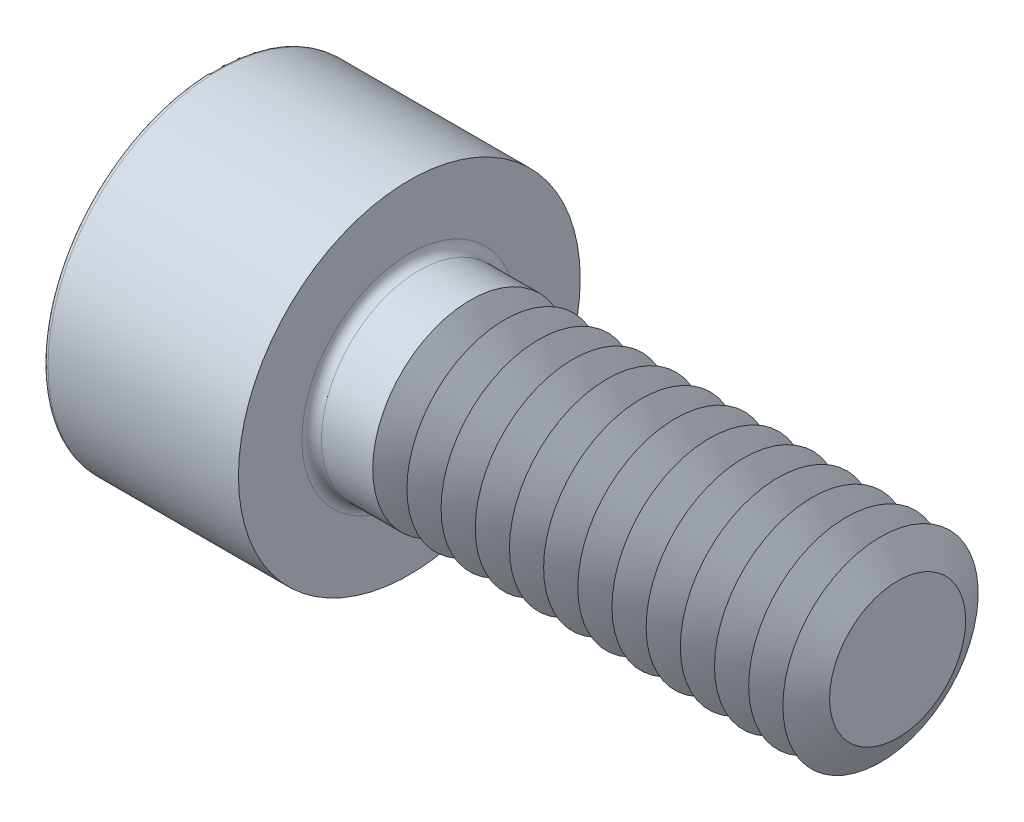
ISO-10303-21;
HEADER;
FILE_DESCRIPTION(('STEP AP214'),'2;1');
FILE_NAME('part.step','',(''),(''),'','','');
FILE_SCHEMA(('AUTOMOTIVE_DESIGN { 1 0 10303 214 1 1 1 1 }'));
ENDSEC;
DATA;
#1=APPLICATION_CONTEXT('core data for automotive mechanical design processes');
#2=APPLICATION_PROTOCOL_DEFINITION('international standard','automotive_design',2000,#1);
#3=PRODUCT_CONTEXT('',#1,'mechanical');
#4=PRODUCT('Part','Part','',(#3));
#5=PRODUCT_RELATED_PRODUCT_CATEGORY('part','',(#4));
#6=PRODUCT_DEFINITION_FORMATION('','',#4);
#7=PRODUCT_DEFINITION_CONTEXT('part definition',#1,'design');
#8=PRODUCT_DEFINITION('design','',#6,#7);
#9=PRODUCT_DEFINITION_SHAPE('','',#8);
#10=(LENGTH_UNIT() NAMED_UNIT(*) SI_UNIT(.MILLI.,.METRE.));
#11=(NAMED_UNIT(*) PLANE_ANGLE_UNIT() SI_UNIT($,.RADIAN.));
#12=(NAMED_UNIT(*) SI_UNIT($,.STERADIAN.) SOLID_ANGLE_UNIT());
#13=UNCERTAINTY_MEASURE_WITH_UNIT(LENGTH_MEASURE(1.E-05),#10,'distance_accuracy_value','');
#14=(GEOMETRIC_REPRESENTATION_CONTEXT(3) GLOBAL_UNCERTAINTY_ASSIGNED_CONTEXT((#13)) GLOBAL_UNIT_ASSIGNED_CONTEXT((#10,
#11,#12)) REPRESENTATION_CONTEXT('',''));
#15=CARTESIAN_POINT('',(0.,0.,0.));
#16=DIRECTION('',(0.,0.,1.));
#17=DIRECTION('',(1.,0.,0.));
#18=AXIS2_PLACEMENT_3D('',#15,#16,#17);
#19=CARTESIAN_POINT('',(0.,0.,0.));
#20=DIRECTION('',(-1.,0.,0.));
#21=DIRECTION('',(0.,0.,1.));
#22=AXIS2_PLACEMENT_3D('',#19,#20,#21);
#23=CYLINDRICAL_SURFACE('',#22,2.);
#24=CARTESIAN_POINT('',(5.95001026681725,0.,0.));
#25=DIRECTION('',(-1.,0.,0.));
#26=DIRECTION('',(0.,0.,1.));
#27=AXIS2_PLACEMENT_3D('',#24,#25,#26);
#28=CIRCLE('',#27,2.);
#29=CARTESIAN_POINT('',(5.95001026681725,0.,2.));
#30=VERTEX_POINT('',#29);
#31=EDGE_CURVE('E331',#30,#30,#28,.T.);
#32=ORIENTED_EDGE('',*,*,#31,.T.);
#33=EDGE_LOOP('',(#32));
#34=FACE_BOUND('',#33,.T.);
#35=CARTESIAN_POINT('',(5.94998973318276,0.,0.));
#36=DIRECTION('',(-1.,0.,0.));
#37=DIRECTION('',(0.,0.,1.));
#38=AXIS2_PLACEMENT_3D('',#35,#36,#37);
#39=CIRCLE('',#38,2.);
#40=CARTESIAN_POINT('',(5.94998973318276,0.,2.));
#41=VERTEX_POINT('',#40);
#42=EDGE_CURVE('E327',#41,#41,#39,.T.);
#43=ORIENTED_EDGE('',*,*,#42,.F.);
#44=EDGE_LOOP('',(#43));
#45=FACE_BOUND('',#44,.T.);
#46=ADVANCED_FACE('F38',(#34,#45),#23,.T.);
#47=CARTESIAN_POINT('',(6.65001026681725,0.,0.));
#48=DIRECTION('',(-1.,0.,0.));
#49=DIRECTION('',(0.,0.,1.));
#50=AXIS2_PLACEMENT_3D('',#47,#48,#49);
#51=CIRCLE('',#50,2.);
#52=CARTESIAN_POINT('',(6.65001026681725,0.,2.));
#53=VERTEX_POINT('',#52);
#54=EDGE_CURVE('E344',#53,#53,#51,.T.);
#55=ORIENTED_EDGE('',*,*,#54,.T.);
#56=EDGE_LOOP('',(#55));
#57=FACE_BOUND('',#56,.T.);
#58=CARTESIAN_POINT('',(6.64998973318276,0.,0.));
#59=DIRECTION('',(-1.,0.,0.));
#60=DIRECTION('',(0.,0.,1.));
#61=AXIS2_PLACEMENT_3D('',#58,#59,#60);
#62=CIRCLE('',#61,2.);
#63=CARTESIAN_POINT('',(6.64998973318276,0.,2.));
#64=VERTEX_POINT('',#63);
#65=EDGE_CURVE('E333',#64,#64,#62,.T.);
#66=ORIENTED_EDGE('',*,*,#65,.F.);
#67=EDGE_LOOP('',(#66));
#68=FACE_BOUND('',#67,.T.);
#69=ADVANCED_FACE('F173',(#57,#68),#23,.T.);
#70=CARTESIAN_POINT('',(7.35001026681725,0.,0.));
#71=DIRECTION('',(-1.,0.,0.));
#72=DIRECTION('',(0.,0.,1.));
#73=AXIS2_PLACEMENT_3D('',#70,#71,#72);
#74=CIRCLE('',#73,2.);
#75=CARTESIAN_POINT('',(7.35001026681725,0.,2.));
#76=VERTEX_POINT('',#75);
#77=EDGE_CURVE('E353',#76,#76,#74,.T.);
#78=ORIENTED_EDGE('',*,*,#77,.T.);
#79=EDGE_LOOP('',(#78));
#80=FACE_BOUND('',#79,.T.);
#81=CARTESIAN_POINT('',(7.34998973318276,0.,0.));
#82=DIRECTION('',(-1.,0.,0.));
#83=DIRECTION('',(0.,0.,1.));
#84=AXIS2_PLACEMENT_3D('',#81,#82,#83);
#85=CIRCLE('',#84,2.);
#86=CARTESIAN_POINT('',(7.34998973318276,0.,2.));
#87=VERTEX_POINT('',#86);
#88=EDGE_CURVE('E347',#87,#87,#85,.T.);
#89=ORIENTED_EDGE('',*,*,#88,.F.);
#90=EDGE_LOOP('',(#89));
#91=FACE_BOUND('',#90,.T.);
#92=ADVANCED_FACE('F178',(#80,#91),#23,.T.);
#93=CARTESIAN_POINT('',(8.05001026681725,0.,0.));
#94=DIRECTION('',(-1.,0.,0.));
#95=DIRECTION('',(0.,0.,1.));
#96=AXIS2_PLACEMENT_3D('',#93,#94,#95);
#97=CIRCLE('',#96,2.);
#98=CARTESIAN_POINT('',(8.05001026681725,0.,2.));
#99=VERTEX_POINT('',#98);
#100=EDGE_CURVE('E362',#99,#99,#97,.T.);
#101=ORIENTED_EDGE('',*,*,#100,.T.);
#102=EDGE_LOOP('',(#101));
#103=FACE_BOUND('',#102,.T.);
#104=CARTESIAN_POINT('',(8.04998973318276,0.,0.));
#105=DIRECTION('',(-1.,0.,0.));
#106=DIRECTION('',(0.,0.,1.));
#107=AXIS2_PLACEMENT_3D('',#104,#105,#106);
#108=CIRCLE('',#107,2.);
#109=CARTESIAN_POINT('',(8.04998973318276,0.,2.));
#110=VERTEX_POINT('',#109);
#111=EDGE_CURVE('E356',#110,#110,#108,.T.);
#112=ORIENTED_EDGE('',*,*,#111,.F.);
#113=EDGE_LOOP('',(#112));
#114=FACE_BOUND('',#113,.T.);
#115=ADVANCED_FACE('F697',(#103,#114),#23,.T.);
#116=CARTESIAN_POINT('',(8.75001026681725,0.,0.));
#117=DIRECTION('',(-1.,0.,0.));
#118=DIRECTION('',(0.,0.,1.));
#119=AXIS2_PLACEMENT_3D('',#116,#117,#118);
#120=CIRCLE('',#119,2.);
#121=CARTESIAN_POINT('',(8.75001026681725,0.,2.));
#122=VERTEX_POINT('',#121);
#123=EDGE_CURVE('E371',#122,#122,#120,.T.);
#124=ORIENTED_EDGE('',*,*,#123,.T.);
#125=EDGE_LOOP('',(#124));
#126=FACE_BOUND('',#125,.T.);
#127=CARTESIAN_POINT('',(8.74998973318276,0.,0.));
#128=DIRECTION('',(-1.,0.,0.));
#129=DIRECTION('',(0.,0.,1.));
#130=AXIS2_PLACEMENT_3D('',#127,#128,#129);
#131=CIRCLE('',#130,2.);
#132=CARTESIAN_POINT('',(8.74998973318276,0.,2.));
#133=VERTEX_POINT('',#132);
#134=EDGE_CURVE('E365',#133,#133,#131,.T.);
#135=ORIENTED_EDGE('',*,*,#134,.F.);
#136=EDGE_LOOP('',(#135));
#137=FACE_BOUND('',#136,.T.);
#138=ADVANCED_FACE('F689',(#126,#137),#23,.T.);
#139=CARTESIAN_POINT('',(9.45001026681725,0.,0.));
#140=DIRECTION('',(-1.,0.,0.));
#141=DIRECTION('',(0.,0.,1.));
#142=AXIS2_PLACEMENT_3D('',#139,#140,#141);
#143=CIRCLE('',#142,2.);
#144=CARTESIAN_POINT('',(9.45001026681725,0.,2.));
#145=VERTEX_POINT('',#144);
#146=EDGE_CURVE('E380',#145,#145,#143,.T.);
#147=ORIENTED_EDGE('',*,*,#146,.T.);
#148=EDGE_LOOP('',(#147));
#149=FACE_BOUND('',#148,.T.);
#150=CARTESIAN_POINT('',(9.44998973318276,0.,0.));
#151=DIRECTION('',(-1.,0.,0.));
#152=DIRECTION('',(0.,0.,1.));
#153=AXIS2_PLACEMENT_3D('',#150,#151,#152);
#154=CIRCLE('',#153,2.);
#155=CARTESIAN_POINT('',(9.44998973318276,0.,2.));
#156=VERTEX_POINT('',#155);
#157=EDGE_CURVE('E374',#156,#156,#154,.T.);
#158=ORIENTED_EDGE('',*,*,#157,.F.);
#159=EDGE_LOOP('',(#158));
#160=FACE_BOUND('',#159,.T.);
#161=ADVANCED_FACE('F681',(#149,#160),#23,.T.);
#162=CARTESIAN_POINT('',(10.1500102668172,0.,0.));
#163=DIRECTION('',(-1.,0.,0.));
#164=DIRECTION('',(0.,0.,1.));
#165=AXIS2_PLACEMENT_3D('',#162,#163,#164);
#166=CIRCLE('',#165,2.);
#167=CARTESIAN_POINT('',(10.1500102668172,0.,2.));
#168=VERTEX_POINT('',#167);
#169=EDGE_CURVE('E389',#168,#168,#166,.T.);
#170=ORIENTED_EDGE('',*,*,#169,.T.);
#171=EDGE_LOOP('',(#170));
#172=FACE_BOUND('',#171,.T.);
#173=CARTESIAN_POINT('',(10.1499897331828,0.,0.));
#174=DIRECTION('',(-1.,0.,0.));
#175=DIRECTION('',(0.,0.,1.));
#176=AXIS2_PLACEMENT_3D('',#173,#174,#175);
#177=CIRCLE('',#176,2.);
#178=CARTESIAN_POINT('',(10.1499897331828,0.,2.));
#179=VERTEX_POINT('',#178);
#180=EDGE_CURVE('E383',#179,#179,#177,.T.);
#181=ORIENTED_EDGE('',*,*,#180,.F.);
#182=EDGE_LOOP('',(#181));
#183=FACE_BOUND('',#182,.T.);
#184=ADVANCED_FACE('F673',(#172,#183),#23,.T.);
#185=CARTESIAN_POINT('',(10.8500102668172,0.,0.));
#186=DIRECTION('',(-1.,0.,0.));
#187=DIRECTION('',(0.,0.,1.));
#188=AXIS2_PLACEMENT_3D('',#185,#186,#187);
#189=CIRCLE('',#188,2.);
#190=CARTESIAN_POINT('',(10.8500102668172,0.,2.));
#191=VERTEX_POINT('',#190);
#192=EDGE_CURVE('E398',#191,#191,#189,.T.);
#193=ORIENTED_EDGE('',*,*,#192,.T.);
#194=EDGE_LOOP('',(#193));
#195=FACE_BOUND('',#194,.T.);
#196=CARTESIAN_POINT('',(10.8499897331828,0.,0.));
#197=DIRECTION('',(-1.,0.,0.));
#198=DIRECTION('',(0.,0.,1.));
#199=AXIS2_PLACEMENT_3D('',#196,#197,#198);
#200=CIRCLE('',#199,2.);
#201=CARTESIAN_POINT('',(10.8499897331828,0.,2.));
#202=VERTEX_POINT('',#201);
#203=EDGE_CURVE('E392',#202,#202,#200,.T.);
#204=ORIENTED_EDGE('',*,*,#203,.F.);
#205=EDGE_LOOP('',(#204));
#206=FACE_BOUND('',#205,.T.);
#207=ADVANCED_FACE('F665',(#195,#206),#23,.T.);
#208=CARTESIAN_POINT('',(11.5500102668172,0.,0.));
#209=DIRECTION('',(-1.,0.,0.));
#210=DIRECTION('',(0.,0.,1.));
#211=AXIS2_PLACEMENT_3D('',#208,#209,#210);
#212=CIRCLE('',#211,2.);
#213=CARTESIAN_POINT('',(11.5500102668172,0.,2.));
#214=VERTEX_POINT('',#213);
#215=EDGE_CURVE('E407',#214,#214,#212,.T.);
#216=ORIENTED_EDGE('',*,*,#215,.T.);
#217=EDGE_LOOP('',(#216));
#218=FACE_BOUND('',#217,.T.);
#219=CARTESIAN_POINT('',(11.5499897331828,0.,0.));
#220=DIRECTION('',(-1.,0.,0.));
#221=DIRECTION('',(0.,0.,1.));
#222=AXIS2_PLACEMENT_3D('',#219,#220,#221);
#223=CIRCLE('',#222,2.);
#224=CARTESIAN_POINT('',(11.5499897331828,0.,2.));
#225=VERTEX_POINT('',#224);
#226=EDGE_CURVE('E401',#225,#225,#223,.T.);
#227=ORIENTED_EDGE('',*,*,#226,.F.);
#228=EDGE_LOOP('',(#227));
#229=FACE_BOUND('',#228,.T.);
#230=ADVANCED_FACE('F656',(#218,#229),#23,.T.);
#231=CARTESIAN_POINT('',(12.2500102668172,0.,0.));
#232=DIRECTION('',(-1.,0.,0.));
#233=DIRECTION('',(0.,0.,1.));
#234=AXIS2_PLACEMENT_3D('',#231,#232,#233);
#235=CIRCLE('',#234,2.);
#236=CARTESIAN_POINT('',(12.2500102668172,0.,2.));
#237=VERTEX_POINT('',#236);
#238=EDGE_CURVE('E416',#237,#237,#235,.T.);
#239=ORIENTED_EDGE('',*,*,#238,.T.);
#240=EDGE_LOOP('',(#239));
#241=FACE_BOUND('',#240,.T.);
#242=CARTESIAN_POINT('',(12.2499897331828,0.,0.));
#243=DIRECTION('',(-1.,0.,0.));
#244=DIRECTION('',(0.,0.,1.));
#245=AXIS2_PLACEMENT_3D('',#242,#243,#244);
#246=CIRCLE('',#245,2.);
#247=CARTESIAN_POINT('',(12.2499897331828,0.,2.));
#248=VERTEX_POINT('',#247);
#249=EDGE_CURVE('E410',#248,#248,#246,.T.);
#250=ORIENTED_EDGE('',*,*,#249,.F.);
#251=EDGE_LOOP('',(#250));
#252=FACE_BOUND('',#251,.T.);
#253=ADVANCED_FACE('F239',(#241,#252),#23,.T.);
#254=CARTESIAN_POINT('',(12.2500102668172,0.,0.));
#255=DIRECTION('',(-1.,0.,0.));
#256=DIRECTION('',(0.,0.,1.));
#257=AXIS2_PLACEMENT_3D('',#254,#255,#256);
#258=CONICAL_SURFACE('',#257,2.,1.04719755119659);
#259=CARTESIAN_POINT('',(12.6,0.,0.));
#260=DIRECTION('',(-1.,0.,0.));
#261=DIRECTION('',(0.,0.,1.));
#262=AXIS2_PLACEMENT_3D('',#259,#260,#261);
#263=CIRCLE('',#262,1.3938);
#264=CARTESIAN_POINT('',(12.6,0.,1.3938));
#265=VERTEX_POINT('',#264);
#266=EDGE_CURVE('E422',#265,#265,#263,.T.);
#267=ORIENTED_EDGE('',*,*,#266,.T.);
#268=EDGE_LOOP('',(#267));
#269=FACE_BOUND('',#268,.T.);
#270=ORIENTED_EDGE('',*,*,#238,.F.);
#271=EDGE_LOOP('',(#270));
#272=FACE_BOUND('',#271,.T.);
#273=ADVANCED_FACE('F235',(#269,#272),#258,.T.);
#274=CARTESIAN_POINT('',(12.6,0.,0.));
#275=DIRECTION('',(1.,0.,0.));
#276=DIRECTION('',(0.,0.,-1.));
#277=AXIS2_PLACEMENT_3D('',#274,#275,#276);
#278=CONICAL_SURFACE('',#277,1.3938,1.04719755119659);
#279=CARTESIAN_POINT('',(12.9499897331828,0.,0.));
#280=DIRECTION('',(-1.,0.,0.));
#281=DIRECTION('',(0.,0.,1.));
#282=AXIS2_PLACEMENT_3D('',#279,#280,#281);
#283=CIRCLE('',#282,2.);
#284=CARTESIAN_POINT('',(12.9499897331828,0.,2.));
#285=VERTEX_POINT('',#284);
#286=EDGE_CURVE('E419',#285,#285,#283,.T.);
#287=ORIENTED_EDGE('',*,*,#286,.T.);
#288=EDGE_LOOP('',(#287));
#289=FACE_BOUND('',#288,.T.);
#290=ORIENTED_EDGE('',*,*,#266,.F.);
#291=EDGE_LOOP('',(#290));
#292=FACE_BOUND('',#291,.T.);
#293=ADVANCED_FACE('F238',(#289,#292),#278,.T.);
#294=CARTESIAN_POINT('',(14.,2.,0.));
#295=DIRECTION('',(-1.,0.,0.));
#296=DIRECTION('',(0.,0.,1.));
#297=AXIS2_PLACEMENT_3D('',#294,#295,#296);
#298=PLANE('',#297);
#299=CARTESIAN_POINT('',(14.,0.,0.));
#300=DIRECTION('',(-1.,0.,0.));
#301=DIRECTION('',(0.,0.,1.));
#302=AXIS2_PLACEMENT_3D('',#299,#300,#301);
#303=CIRCLE('',#302,1.3938);
#304=CARTESIAN_POINT('',(14.,0.,1.3938));
#305=VERTEX_POINT('',#304);
#306=EDGE_CURVE('E128',#305,#305,#303,.T.);
#307=ORIENTED_EDGE('',*,*,#306,.F.);
#308=EDGE_LOOP('',(#307));
#309=FACE_BOUND('',#308,.T.);
#310=ADVANCED_FACE('F184',(#309),#298,.F.);
#311=CARTESIAN_POINT('',(13.6500102668172,0.,0.));
#312=DIRECTION('',(-1.,0.,0.));
#313=DIRECTION('',(0.,0.,1.));
#314=AXIS2_PLACEMENT_3D('',#311,#312,#313);
#315=CONICAL_SURFACE('',#314,2.,1.04719755119659);
#316=ORIENTED_EDGE('',*,*,#306,.T.);
#317=EDGE_LOOP('',(#316));
#318=FACE_BOUND('',#317,.T.);
#319=CARTESIAN_POINT('',(13.6500102668172,0.,0.));
#320=DIRECTION('',(-1.,0.,0.));
#321=DIRECTION('',(0.,0.,1.));
#322=AXIS2_PLACEMENT_3D('',#319,#320,#321);
#323=CIRCLE('',#322,2.);
#324=CARTESIAN_POINT('',(13.6500102668172,0.,2.));
#325=VERTEX_POINT('',#324);
#326=EDGE_CURVE('E434',#325,#325,#323,.T.);
#327=ORIENTED_EDGE('',*,*,#326,.F.);
#328=EDGE_LOOP('',(#327));
#329=FACE_BOUND('',#328,.T.);
#330=ADVANCED_FACE('F222',(#318,#329),#315,.T.);
#331=ORIENTED_EDGE('',*,*,#326,.T.);
#332=EDGE_LOOP('',(#331));
#333=FACE_BOUND('',#332,.T.);
#334=CARTESIAN_POINT('',(13.6499897331828,0.,0.));
#335=DIRECTION('',(-1.,0.,0.));
#336=DIRECTION('',(0.,0.,1.));
#337=AXIS2_PLACEMENT_3D('',#334,#335,#336);
#338=CIRCLE('',#337,2.);
#339=CARTESIAN_POINT('',(13.6499897331828,0.,2.));
#340=VERTEX_POINT('',#339);
#341=EDGE_CURVE('E428',#340,#340,#338,.T.);
#342=ORIENTED_EDGE('',*,*,#341,.F.);
#343=EDGE_LOOP('',(#342));
#344=FACE_BOUND('',#343,.T.);
#345=ADVANCED_FACE('F170',(#333,#344),#23,.T.);
#346=CARTESIAN_POINT('',(13.3,0.,0.));
#347=DIRECTION('',(1.,0.,0.));
#348=DIRECTION('',(0.,0.,-1.));
#349=AXIS2_PLACEMENT_3D('',#346,#347,#348);
#350=CONICAL_SURFACE('',#349,1.3938,1.04719755119659);
#351=ORIENTED_EDGE('',*,*,#341,.T.);
#352=EDGE_LOOP('',(#351));
#353=FACE_BOUND('',#352,.T.);
#354=CARTESIAN_POINT('',(13.3,0.,0.));
#355=DIRECTION('',(-1.,0.,0.));
#356=DIRECTION('',(0.,0.,1.));
#357=AXIS2_PLACEMENT_3D('',#354,#355,#356);
#358=CIRCLE('',#357,1.3938);
#359=CARTESIAN_POINT('',(13.3,0.,1.3938));
#360=VERTEX_POINT('',#359);
#361=EDGE_CURVE('E431',#360,#360,#358,.T.);
#362=ORIENTED_EDGE('',*,*,#361,.F.);
#363=EDGE_LOOP('',(#362));
#364=FACE_BOUND('',#363,.T.);
#365=ADVANCED_FACE('F230',(#353,#364),#350,.T.);
#366=CARTESIAN_POINT('',(12.9500102668172,0.,0.));
#367=DIRECTION('',(-1.,0.,0.));
#368=DIRECTION('',(0.,0.,1.));
#369=AXIS2_PLACEMENT_3D('',#366,#367,#368);
#370=CONICAL_SURFACE('',#369,2.,1.04719755119659);
#371=ORIENTED_EDGE('',*,*,#361,.T.);
#372=EDGE_LOOP('',(#371));
#373=FACE_BOUND('',#372,.T.);
#374=CARTESIAN_POINT('',(12.9500102668172,0.,0.));
#375=DIRECTION('',(-1.,0.,0.));
#376=DIRECTION('',(0.,0.,1.));
#377=AXIS2_PLACEMENT_3D('',#374,#375,#376);
#378=CIRCLE('',#377,2.);
#379=CARTESIAN_POINT('',(12.9500102668172,0.,2.));
#380=VERTEX_POINT('',#379);
#381=EDGE_CURVE('E425',#380,#380,#378,.T.);
#382=ORIENTED_EDGE('',*,*,#381,.F.);
#383=EDGE_LOOP('',(#382));
#384=FACE_BOUND('',#383,.T.);
#385=ADVANCED_FACE('F226',(#373,#384),#370,.T.);
#386=ORIENTED_EDGE('',*,*,#381,.T.);
#387=EDGE_LOOP('',(#386));
#388=FACE_BOUND('',#387,.T.);
#389=ORIENTED_EDGE('',*,*,#286,.F.);
#390=EDGE_LOOP('',(#389));
#391=FACE_BOUND('',#390,.T.);
#392=ADVANCED_FACE('F229',(#388,#391),#23,.T.);
#393=CARTESIAN_POINT('',(11.5500102668172,0.,0.));
#394=DIRECTION('',(-1.,0.,0.));
#395=DIRECTION('',(0.,0.,1.));
#396=AXIS2_PLACEMENT_3D('',#393,#394,#395);
#397=CONICAL_SURFACE('',#396,2.,1.04719755119659);
#398=CARTESIAN_POINT('',(11.9,0.,0.));
#399=DIRECTION('',(-1.,0.,0.));
#400=DIRECTION('',(0.,0.,1.));
#401=AXIS2_PLACEMENT_3D('',#398,#399,#400);
#402=CIRCLE('',#401,1.3938);
#403=CARTESIAN_POINT('',(11.9,0.,1.3938));
#404=VERTEX_POINT('',#403);
#405=EDGE_CURVE('E413',#404,#404,#402,.T.);
#406=ORIENTED_EDGE('',*,*,#405,.T.);
#407=EDGE_LOOP('',(#406));
#408=FACE_BOUND('',#407,.T.);
#409=ORIENTED_EDGE('',*,*,#215,.F.);
#410=EDGE_LOOP('',(#409));
#411=FACE_BOUND('',#410,.T.);
#412=ADVANCED_FACE('F244',(#408,#411),#397,.T.);
#413=CARTESIAN_POINT('',(11.9,0.,0.));
#414=DIRECTION('',(1.,0.,0.));
#415=DIRECTION('',(0.,0.,-1.));
#416=AXIS2_PLACEMENT_3D('',#413,#414,#415);
#417=CONICAL_SURFACE('',#416,1.3938,1.04719755119659);
#418=ORIENTED_EDGE('',*,*,#249,.T.);
#419=EDGE_LOOP('',(#418));
#420=FACE_BOUND('',#419,.T.);
#421=ORIENTED_EDGE('',*,*,#405,.F.);
#422=EDGE_LOOP('',(#421));
#423=FACE_BOUND('',#422,.T.);
#424=ADVANCED_FACE('F247',(#420,#423),#417,.T.);
#425=CARTESIAN_POINT('',(10.8500102668172,0.,0.));
#426=DIRECTION('',(-1.,0.,0.));
#427=DIRECTION('',(0.,0.,1.));
#428=AXIS2_PLACEMENT_3D('',#425,#426,#427);
#429=CONICAL_SURFACE('',#428,2.,1.04719755119659);
#430=CARTESIAN_POINT('',(11.2,0.,0.));
#431=DIRECTION('',(-1.,0.,0.));
#432=DIRECTION('',(0.,0.,1.));
#433=AXIS2_PLACEMENT_3D('',#430,#431,#432);
#434=CIRCLE('',#433,1.3938);
#435=CARTESIAN_POINT('',(11.2,0.,1.3938));
#436=VERTEX_POINT('',#435);
#437=EDGE_CURVE('E404',#436,#436,#434,.T.);
#438=ORIENTED_EDGE('',*,*,#437,.T.);
#439=EDGE_LOOP('',(#438));
#440=FACE_BOUND('',#439,.T.);
#441=ORIENTED_EDGE('',*,*,#192,.F.);
#442=EDGE_LOOP('',(#441));
#443=FACE_BOUND('',#442,.T.);
#444=ADVANCED_FACE('F251',(#440,#443),#429,.T.);
#445=CARTESIAN_POINT('',(11.2,0.,0.));
#446=DIRECTION('',(1.,0.,0.));
#447=DIRECTION('',(0.,0.,-1.));
#448=AXIS2_PLACEMENT_3D('',#445,#446,#447);
#449=CONICAL_SURFACE('',#448,1.3938,1.04719755119659);
#450=ORIENTED_EDGE('',*,*,#226,.T.);
#451=EDGE_LOOP('',(#450));
#452=FACE_BOUND('',#451,.T.);
#453=ORIENTED_EDGE('',*,*,#437,.F.);
#454=EDGE_LOOP('',(#453));
#455=FACE_BOUND('',#454,.T.);
#456=ADVANCED_FACE('F255',(#452,#455),#449,.T.);
#457=CARTESIAN_POINT('',(10.1500102668172,0.,0.));
#458=DIRECTION('',(-1.,0.,0.));
#459=DIRECTION('',(0.,0.,1.));
#460=AXIS2_PLACEMENT_3D('',#457,#458,#459);
#461=CONICAL_SURFACE('',#460,2.,1.04719755119659);
#462=CARTESIAN_POINT('',(10.5,0.,0.));
#463=DIRECTION('',(-1.,0.,0.));
#464=DIRECTION('',(0.,0.,1.));
#465=AXIS2_PLACEMENT_3D('',#462,#463,#464);
#466=CIRCLE('',#465,1.3938);
#467=CARTESIAN_POINT('',(10.5,0.,1.3938));
#468=VERTEX_POINT('',#467);
#469=EDGE_CURVE('E395',#468,#468,#466,.T.);
#470=ORIENTED_EDGE('',*,*,#469,.T.);
#471=EDGE_LOOP('',(#470));
#472=FACE_BOUND('',#471,.T.);
#473=ORIENTED_EDGE('',*,*,#169,.F.);
#474=EDGE_LOOP('',(#473));
#475=FACE_BOUND('',#474,.T.);
#476=ADVANCED_FACE('F259',(#472,#475),#461,.T.);
#477=CARTESIAN_POINT('',(10.5,0.,0.));
#478=DIRECTION('',(1.,0.,0.));
#479=DIRECTION('',(0.,0.,-1.));
#480=AXIS2_PLACEMENT_3D('',#477,#478,#479);
#481=CONICAL_SURFACE('',#480,1.3938,1.04719755119659);
#482=ORIENTED_EDGE('',*,*,#203,.T.);
#483=EDGE_LOOP('',(#482));
#484=FACE_BOUND('',#483,.T.);
#485=ORIENTED_EDGE('',*,*,#469,.F.);
#486=EDGE_LOOP('',(#485));
#487=FACE_BOUND('',#486,.T.);
#488=ADVANCED_FACE('F263',(#484,#487),#481,.T.);
#489=CARTESIAN_POINT('',(9.45001026681725,0.,0.));
#490=DIRECTION('',(-1.,0.,0.));
#491=DIRECTION('',(0.,0.,1.));
#492=AXIS2_PLACEMENT_3D('',#489,#490,#491);
#493=CONICAL_SURFACE('',#492,2.,1.04719755119659);
#494=CARTESIAN_POINT('',(9.8,0.,0.));
#495=DIRECTION('',(-1.,0.,0.));
#496=DIRECTION('',(0.,0.,1.));
#497=AXIS2_PLACEMENT_3D('',#494,#495,#496);
#498=CIRCLE('',#497,1.3938);
#499=CARTESIAN_POINT('',(9.8,0.,1.3938));
#500=VERTEX_POINT('',#499);
#501=EDGE_CURVE('E386',#500,#500,#498,.T.);
#502=ORIENTED_EDGE('',*,*,#501,.T.);
#503=EDGE_LOOP('',(#502));
#504=FACE_BOUND('',#503,.T.);
#505=ORIENTED_EDGE('',*,*,#146,.F.);
#506=EDGE_LOOP('',(#505));
#507=FACE_BOUND('',#506,.T.);
#508=ADVANCED_FACE('F267',(#504,#507),#493,.T.);
#509=CARTESIAN_POINT('',(9.8,0.,0.));
#510=DIRECTION('',(1.,0.,0.));
#511=DIRECTION('',(0.,0.,-1.));
#512=AXIS2_PLACEMENT_3D('',#509,#510,#511);
#513=CONICAL_SURFACE('',#512,1.3938,1.04719755119659);
#514=ORIENTED_EDGE('',*,*,#180,.T.);
#515=EDGE_LOOP('',(#514));
#516=FACE_BOUND('',#515,.T.);
#517=ORIENTED_EDGE('',*,*,#501,.F.);
#518=EDGE_LOOP('',(#517));
#519=FACE_BOUND('',#518,.T.);
#520=ADVANCED_FACE('F271',(#516,#519),#513,.T.);
#521=CARTESIAN_POINT('',(8.75001026681725,0.,0.));
#522=DIRECTION('',(-1.,0.,0.));
#523=DIRECTION('',(0.,0.,1.));
#524=AXIS2_PLACEMENT_3D('',#521,#522,#523);
#525=CONICAL_SURFACE('',#524,2.,1.04719755119659);
#526=CARTESIAN_POINT('',(9.1,0.,0.));
#527=DIRECTION('',(-1.,0.,0.));
#528=DIRECTION('',(0.,0.,1.));
#529=AXIS2_PLACEMENT_3D('',#526,#527,#528);
#530=CIRCLE('',#529,1.3938);
#531=CARTESIAN_POINT('',(9.1,0.,1.3938));
#532=VERTEX_POINT('',#531);
#533=EDGE_CURVE('E377',#532,#532,#530,.T.);
#534=ORIENTED_EDGE('',*,*,#533,.T.);
#535=EDGE_LOOP('',(#534));
#536=FACE_BOUND('',#535,.T.);
#537=ORIENTED_EDGE('',*,*,#123,.F.);
#538=EDGE_LOOP('',(#537));
#539=FACE_BOUND('',#538,.T.);
#540=ADVANCED_FACE('F275',(#536,#539),#525,.T.);
#541=CARTESIAN_POINT('',(9.1,0.,0.));
#542=DIRECTION('',(1.,0.,0.));
#543=DIRECTION('',(0.,0.,-1.));
#544=AXIS2_PLACEMENT_3D('',#541,#542,#543);
#545=CONICAL_SURFACE('',#544,1.3938,1.04719755119659);
#546=ORIENTED_EDGE('',*,*,#157,.T.);
#547=EDGE_LOOP('',(#546));
#548=FACE_BOUND('',#547,.T.);
#549=ORIENTED_EDGE('',*,*,#533,.F.);
#550=EDGE_LOOP('',(#549));
#551=FACE_BOUND('',#550,.T.);
#552=ADVANCED_FACE('F279',(#548,#551),#545,.T.);
#553=CARTESIAN_POINT('',(8.05001026681725,0.,0.));
#554=DIRECTION('',(-1.,0.,0.));
#555=DIRECTION('',(0.,0.,1.));
#556=AXIS2_PLACEMENT_3D('',#553,#554,#555);
#557=CONICAL_SURFACE('',#556,2.,1.04719755119659);
#558=CARTESIAN_POINT('',(8.4,0.,0.));
#559=DIRECTION('',(-1.,0.,0.));
#560=DIRECTION('',(0.,0.,1.));
#561=AXIS2_PLACEMENT_3D('',#558,#559,#560);
#562=CIRCLE('',#561,1.3938);
#563=CARTESIAN_POINT('',(8.4,0.,1.3938));
#564=VERTEX_POINT('',#563);
#565=EDGE_CURVE('E368',#564,#564,#562,.T.);
#566=ORIENTED_EDGE('',*,*,#565,.T.);
#567=EDGE_LOOP('',(#566));
#568=FACE_BOUND('',#567,.T.);
#569=ORIENTED_EDGE('',*,*,#100,.F.);
#570=EDGE_LOOP('',(#569));
#571=FACE_BOUND('',#570,.T.);
#572=ADVANCED_FACE('F283',(#568,#571),#557,.T.);
#573=CARTESIAN_POINT('',(8.4,0.,0.));
#574=DIRECTION('',(1.,0.,0.));
#575=DIRECTION('',(0.,0.,-1.));
#576=AXIS2_PLACEMENT_3D('',#573,#574,#575);
#577=CONICAL_SURFACE('',#576,1.3938,1.04719755119659);
#578=ORIENTED_EDGE('',*,*,#134,.T.);
#579=EDGE_LOOP('',(#578));
#580=FACE_BOUND('',#579,.T.);
#581=ORIENTED_EDGE('',*,*,#565,.F.);
#582=EDGE_LOOP('',(#581));
#583=FACE_BOUND('',#582,.T.);
#584=ADVANCED_FACE('F287',(#580,#583),#577,.T.);
#585=CARTESIAN_POINT('',(7.35001026681725,0.,0.));
#586=DIRECTION('',(-1.,0.,0.));
#587=DIRECTION('',(0.,0.,1.));
#588=AXIS2_PLACEMENT_3D('',#585,#586,#587);
#589=CONICAL_SURFACE('',#588,2.,1.04719755119659);
#590=CARTESIAN_POINT('',(7.7,0.,0.));
#591=DIRECTION('',(-1.,0.,0.));
#592=DIRECTION('',(0.,0.,1.));
#593=AXIS2_PLACEMENT_3D('',#590,#591,#592);
#594=CIRCLE('',#593,1.3938);
#595=CARTESIAN_POINT('',(7.7,0.,1.3938));
#596=VERTEX_POINT('',#595);
#597=EDGE_CURVE('E359',#596,#596,#594,.T.);
#598=ORIENTED_EDGE('',*,*,#597,.T.);
#599=EDGE_LOOP('',(#598));
#600=FACE_BOUND('',#599,.T.);
#601=ORIENTED_EDGE('',*,*,#77,.F.);
#602=EDGE_LOOP('',(#601));
#603=FACE_BOUND('',#602,.T.);
#604=ADVANCED_FACE('F291',(#600,#603),#589,.T.);
#605=CARTESIAN_POINT('',(7.7,0.,0.));
#606=DIRECTION('',(1.,0.,0.));
#607=DIRECTION('',(0.,0.,-1.));
#608=AXIS2_PLACEMENT_3D('',#605,#606,#607);
#609=CONICAL_SURFACE('',#608,1.3938,1.04719755119659);
#610=ORIENTED_EDGE('',*,*,#111,.T.);
#611=EDGE_LOOP('',(#610));
#612=FACE_BOUND('',#611,.T.);
#613=ORIENTED_EDGE('',*,*,#597,.F.);
#614=EDGE_LOOP('',(#613));
#615=FACE_BOUND('',#614,.T.);
#616=ADVANCED_FACE('F295',(#612,#615),#609,.T.);
#617=CARTESIAN_POINT('',(6.65001026681725,0.,0.));
#618=DIRECTION('',(-1.,0.,0.));
#619=DIRECTION('',(0.,0.,1.));
#620=AXIS2_PLACEMENT_3D('',#617,#618,#619);
#621=CONICAL_SURFACE('',#620,2.,1.04719755119659);
#622=CARTESIAN_POINT('',(7.,0.,0.));
#623=DIRECTION('',(-1.,0.,0.));
#624=DIRECTION('',(0.,0.,1.));
#625=AXIS2_PLACEMENT_3D('',#622,#623,#624);
#626=CIRCLE('',#625,1.3938);
#627=CARTESIAN_POINT('',(7.,0.,1.3938));
#628=VERTEX_POINT('',#627);
#629=EDGE_CURVE('E350',#628,#628,#626,.T.);
#630=ORIENTED_EDGE('',*,*,#629,.T.);
#631=EDGE_LOOP('',(#630));
#632=FACE_BOUND('',#631,.T.);
#633=ORIENTED_EDGE('',*,*,#54,.F.);
#634=EDGE_LOOP('',(#633));
#635=FACE_BOUND('',#634,.T.);
#636=ADVANCED_FACE('F299',(#632,#635),#621,.T.);
#637=CARTESIAN_POINT('',(7.,0.,0.));
#638=DIRECTION('',(1.,0.,0.));
#639=DIRECTION('',(0.,0.,-1.));
#640=AXIS2_PLACEMENT_3D('',#637,#638,#639);
#641=CONICAL_SURFACE('',#640,1.3938,1.04719755119659);
#642=ORIENTED_EDGE('',*,*,#88,.T.);
#643=EDGE_LOOP('',(#642));
#644=FACE_BOUND('',#643,.T.);
#645=ORIENTED_EDGE('',*,*,#629,.F.);
#646=EDGE_LOOP('',(#645));
#647=FACE_BOUND('',#646,.T.);
#648=ADVANCED_FACE('F303',(#644,#647),#641,.T.);
#649=CARTESIAN_POINT('',(5.95001026681725,0.,0.));
#650=DIRECTION('',(-1.,0.,0.));
#651=DIRECTION('',(0.,0.,1.));
#652=AXIS2_PLACEMENT_3D('',#649,#650,#651);
#653=CONICAL_SURFACE('',#652,2.,1.04719755119659);
#654=CARTESIAN_POINT('',(6.3,0.,0.));
#655=DIRECTION('',(-1.,0.,0.));
#656=DIRECTION('',(0.,0.,1.));
#657=AXIS2_PLACEMENT_3D('',#654,#655,#656);
#658=CIRCLE('',#657,1.3938);
#659=CARTESIAN_POINT('',(6.3,0.,1.3938));
#660=VERTEX_POINT('',#659);
#661=EDGE_CURVE('E341',#660,#660,#658,.T.);
#662=ORIENTED_EDGE('',*,*,#661,.T.);
#663=EDGE_LOOP('',(#662));
#664=FACE_BOUND('',#663,.T.);
#665=ORIENTED_EDGE('',*,*,#31,.F.);
#666=EDGE_LOOP('',(#665));
#667=FACE_BOUND('',#666,.T.);
#668=ADVANCED_FACE('F307',(#664,#667),#653,.T.);
#669=CARTESIAN_POINT('',(6.3,0.,0.));
#670=DIRECTION('',(1.,0.,0.));
#671=DIRECTION('',(0.,0.,-1.));
#672=AXIS2_PLACEMENT_3D('',#669,#670,#671);
#673=CONICAL_SURFACE('',#672,1.3938,1.04719755119659);
#674=ORIENTED_EDGE('',*,*,#65,.T.);
#675=EDGE_LOOP('',(#674));
#676=FACE_BOUND('',#675,.T.);
#677=ORIENTED_EDGE('',*,*,#661,.F.);
#678=EDGE_LOOP('',(#677));
#679=FACE_BOUND('',#678,.T.);
#680=ADVANCED_FACE('F311',(#676,#679),#673,.T.);
#681=CARTESIAN_POINT('',(5.25001026681725,0.,0.));
#682=DIRECTION('',(-1.,0.,0.));
#683=DIRECTION('',(0.,0.,1.));
#684=AXIS2_PLACEMENT_3D('',#681,#682,#683);
#685=CONICAL_SURFACE('',#684,2.,1.04719755119659);
#686=CARTESIAN_POINT('',(5.6,0.,0.));
#687=DIRECTION('',(-1.,0.,0.));
#688=DIRECTION('',(0.,0.,1.));
#689=AXIS2_PLACEMENT_3D('',#686,#687,#688);
#690=CIRCLE('',#689,1.3938);
#691=CARTESIAN_POINT('',(5.6,0.,1.3938));
#692=VERTEX_POINT('',#691);
#693=EDGE_CURVE('E330',#692,#692,#690,.T.);
#694=ORIENTED_EDGE('',*,*,#693,.T.);
#695=EDGE_LOOP('',(#694));
#696=FACE_BOUND('',#695,.T.);
#697=CARTESIAN_POINT('',(5.25001026681725,0.,0.));
#698=DIRECTION('',(-1.,0.,0.));
#699=DIRECTION('',(0.,0.,1.));
#700=AXIS2_PLACEMENT_3D('',#697,#698,#699);
#701=CIRCLE('',#700,2.);
#702=CARTESIAN_POINT('',(5.25001026681725,0.,2.));
#703=VERTEX_POINT('',#702);
#704=EDGE_CURVE('E335',#703,#703,#701,.T.);
#705=ORIENTED_EDGE('',*,*,#704,.F.);
#706=EDGE_LOOP('',(#705));
#707=FACE_BOUND('',#706,.T.);
#708=ADVANCED_FACE('F315',(#696,#707),#685,.T.);
#709=CARTESIAN_POINT('',(5.6,0.,0.));
#710=DIRECTION('',(1.,0.,0.));
#711=DIRECTION('',(0.,0.,-1.));
#712=AXIS2_PLACEMENT_3D('',#709,#710,#711);
#713=CONICAL_SURFACE('',#712,1.3938,1.04719755119659);
#714=ORIENTED_EDGE('',*,*,#42,.T.);
#715=EDGE_LOOP('',(#714));
#716=FACE_BOUND('',#715,.T.);
#717=ORIENTED_EDGE('',*,*,#693,.F.);
#718=EDGE_LOOP('',(#717));
#719=FACE_BOUND('',#718,.T.);
#720=ADVANCED_FACE('F221',(#716,#719),#713,.T.);
#721=CARTESIAN_POINT('',(2.,1.48956369450923,2.58));
#722=DIRECTION('',(-1.,0.,0.));
#723=DIRECTION('',(0.,0.,1.));
#724=AXIS2_PLACEMENT_3D('',#721,#722,#723);
#725=PLANE('',#724);
#726=DIRECTION('',(0.,0.866025403784439,0.5));
#727=VECTOR('',#726,1.);
#728=CARTESIAN_POINT('',(2.,-1.48956369450923,0.86));
#729=LINE('',#728,#727);
#730=CARTESIAN_POINT('',(2.,-1.48956369450923,0.86));
#731=VERTEX_POINT('',#730);
#732=CARTESIAN_POINT('',(2.,0.,1.72));
#733=VERTEX_POINT('',#732);
#734=EDGE_CURVE('E139',#731,#733,#729,.T.);
#735=ORIENTED_EDGE('',*,*,#734,.T.);
#736=DIRECTION('',(0.,0.866025403784438,-0.5));
#737=VECTOR('',#736,1.);
#738=CARTESIAN_POINT('',(2.,0.,1.72));
#739=LINE('',#738,#737);
#740=CARTESIAN_POINT('',(2.,1.48956369450923,0.859999999999999));
#741=VERTEX_POINT('',#740);
#742=EDGE_CURVE('E121',#733,#741,#739,.T.);
#743=ORIENTED_EDGE('',*,*,#742,.T.);
#744=DIRECTION('',(0.,0.,-1.));
#745=VECTOR('',#744,1.);
#746=CARTESIAN_POINT('',(2.,1.48956369450923,0.859999999999999));
#747=LINE('',#746,#745);
#748=CARTESIAN_POINT('',(2.,1.48956369450923,-0.86));
#749=VERTEX_POINT('',#748);
#750=EDGE_CURVE('E119',#741,#749,#747,.T.);
#751=ORIENTED_EDGE('',*,*,#750,.T.);
#752=DIRECTION('',(0.,-0.866025403784439,-0.5));
#753=VECTOR('',#752,1.);
#754=CARTESIAN_POINT('',(2.,1.48956369450923,-0.86));
#755=LINE('',#754,#753);
#756=CARTESIAN_POINT('',(2.,0.,-1.72));
#757=VERTEX_POINT('',#756);
#758=EDGE_CURVE('E98',#749,#757,#755,.T.);
#759=ORIENTED_EDGE('',*,*,#758,.T.);
#760=DIRECTION('',(0.,-0.866025403784438,0.5));
#761=VECTOR('',#760,1.);
#762=CARTESIAN_POINT('',(2.,0.,-1.72));
#763=LINE('',#762,#761);
#764=CARTESIAN_POINT('',(2.,-1.48956369450923,-0.86));
#765=VERTEX_POINT('',#764);
#766=EDGE_CURVE('E109',#757,#765,#763,.T.);
#767=ORIENTED_EDGE('',*,*,#766,.T.);
#768=DIRECTION('',(0.,0.,1.));
#769=VECTOR('',#768,1.);
#770=CARTESIAN_POINT('',(2.,-1.48956369450923,-0.86));
#771=LINE('',#770,#769);
#772=EDGE_CURVE('E113',#765,#731,#771,.T.);
#773=ORIENTED_EDGE('',*,*,#772,.T.);
#774=EDGE_LOOP('',(#735,#743,#751,#759,#767,#773));
#775=FACE_BOUND('',#774,.T.);
#776=ADVANCED_FACE('F116',(#775),#725,.T.);
#777=CARTESIAN_POINT('',(2.,1.48956369450923,0.859999999999999));
#778=DIRECTION('',(0.,1.,0.));
#779=DIRECTION('',(0.,0.,1.));
#780=AXIS2_PLACEMENT_3D('',#777,#778,#779);
#781=PLANE('',#780);
#782=DIRECTION('',(0.,0.,-1.));
#783=VECTOR('',#782,1.);
#784=CARTESIAN_POINT('',(0.,1.48956369450923,0.859999999999999));
#785=LINE('',#784,#783);
#786=CARTESIAN_POINT('',(0.,1.48956369450923,0.859999999999999));
#787=VERTEX_POINT('',#786);
#788=CARTESIAN_POINT('',(0.,1.48956369450923,-0.86));
#789=VERTEX_POINT('',#788);
#790=EDGE_CURVE('E131',#787,#789,#785,.T.);
#791=ORIENTED_EDGE('',*,*,#790,.T.);
#792=DIRECTION('',(-1.,0.,0.));
#793=VECTOR('',#792,1.);
#794=CARTESIAN_POINT('',(2.,1.48956369450923,-0.86));
#795=LINE('',#794,#793);
#796=EDGE_CURVE('E106',#749,#789,#795,.T.);
#797=ORIENTED_EDGE('',*,*,#796,.F.);
#798=ORIENTED_EDGE('',*,*,#750,.F.);
#799=DIRECTION('',(-1.,0.,0.));
#800=VECTOR('',#799,1.);
#801=CARTESIAN_POINT('',(2.,1.48956369450923,0.859999999999999));
#802=LINE('',#801,#800);
#803=EDGE_CURVE('E144',#741,#787,#802,.T.);
#804=ORIENTED_EDGE('',*,*,#803,.T.);
#805=EDGE_LOOP('',(#791,#797,#798,#804));
#806=FACE_BOUND('',#805,.T.);
#807=ADVANCED_FACE('F209',(#806),#781,.F.);
#808=CARTESIAN_POINT('',(2.,1.48956369450923,-0.86));
#809=DIRECTION('',(0.,0.5,-0.866025403784439));
#810=DIRECTION('',(0.,0.866025403784439,0.5));
#811=AXIS2_PLACEMENT_3D('',#808,#809,#810);
#812=PLANE('',#811);
#813=DIRECTION('',(0.,-0.866025403784439,-0.5));
#814=VECTOR('',#813,1.);
#815=CARTESIAN_POINT('',(0.,1.48956369450923,-0.86));
#816=LINE('',#815,#814);
#817=CARTESIAN_POINT('',(0.,0.,-1.72));
#818=VERTEX_POINT('',#817);
#819=EDGE_CURVE('E101',#789,#818,#816,.T.);
#820=ORIENTED_EDGE('',*,*,#819,.T.);
#821=DIRECTION('',(-1.,0.,0.));
#822=VECTOR('',#821,1.);
#823=CARTESIAN_POINT('',(2.,0.,-1.72));
#824=LINE('',#823,#822);
#825=EDGE_CURVE('E94',#757,#818,#824,.T.);
#826=ORIENTED_EDGE('',*,*,#825,.F.);
#827=ORIENTED_EDGE('',*,*,#758,.F.);
#828=ORIENTED_EDGE('',*,*,#796,.T.);
#829=EDGE_LOOP('',(#820,#826,#827,#828));
#830=FACE_BOUND('',#829,.T.);
#831=ADVANCED_FACE('F96',(#830),#812,.F.);
#832=CARTESIAN_POINT('',(2.,0.,-1.72));
#833=DIRECTION('',(0.,-0.5,-0.866025403784439));
#834=DIRECTION('',(0.,0.866025403784438,-0.5));
#835=AXIS2_PLACEMENT_3D('',#832,#833,#834);
#836=PLANE('',#835);
#837=DIRECTION('',(0.,-0.866025403784438,0.5));
#838=VECTOR('',#837,1.);
#839=CARTESIAN_POINT('',(0.,0.,-1.72));
#840=LINE('',#839,#838);
#841=CARTESIAN_POINT('',(0.,-1.48956369450923,-0.86));
#842=VERTEX_POINT('',#841);
#843=EDGE_CURVE('E135',#818,#842,#840,.T.);
#844=ORIENTED_EDGE('',*,*,#843,.T.);
#845=DIRECTION('',(-1.,0.,0.));
#846=VECTOR('',#845,1.);
#847=CARTESIAN_POINT('',(2.,-1.48956369450923,-0.86));
#848=LINE('',#847,#846);
#849=EDGE_CURVE('E105',#765,#842,#848,.T.);
#850=ORIENTED_EDGE('',*,*,#849,.F.);
#851=ORIENTED_EDGE('',*,*,#766,.F.);
#852=ORIENTED_EDGE('',*,*,#825,.T.);
#853=EDGE_LOOP('',(#844,#850,#851,#852));
#854=FACE_BOUND('',#853,.T.);
#855=ADVANCED_FACE('F110',(#854),#836,.F.);
#856=CARTESIAN_POINT('',(2.,-1.48956369450923,-0.86));
#857=DIRECTION('',(0.,-1.,0.));
#858=DIRECTION('',(0.,0.,-1.));
#859=AXIS2_PLACEMENT_3D('',#856,#857,#858);
#860=PLANE('',#859);
#861=DIRECTION('',(0.,0.,1.));
#862=VECTOR('',#861,1.);
#863=CARTESIAN_POINT('',(0.,-1.48956369450923,-0.86));
#864=LINE('',#863,#862);
#865=CARTESIAN_POINT('',(0.,-1.48956369450923,0.86));
#866=VERTEX_POINT('',#865);
#867=EDGE_CURVE('E137',#842,#866,#864,.T.);
#868=ORIENTED_EDGE('',*,*,#867,.T.);
#869=DIRECTION('',(-1.,0.,0.));
#870=VECTOR('',#869,1.);
#871=CARTESIAN_POINT('',(2.,-1.48956369450923,0.86));
#872=LINE('',#871,#870);
#873=EDGE_CURVE('E61',#731,#866,#872,.T.);
#874=ORIENTED_EDGE('',*,*,#873,.F.);
#875=ORIENTED_EDGE('',*,*,#772,.F.);
#876=ORIENTED_EDGE('',*,*,#849,.T.);
#877=EDGE_LOOP('',(#868,#874,#875,#876));
#878=FACE_BOUND('',#877,.T.);
#879=ADVANCED_FACE('F207',(#878),#860,.F.);
#880=CARTESIAN_POINT('',(2.,-1.48956369450923,0.86));
#881=DIRECTION('',(0.,-0.5,0.866025403784439));
#882=DIRECTION('',(0.,-0.866025403784439,-0.5));
#883=AXIS2_PLACEMENT_3D('',#880,#881,#882);
#884=PLANE('',#883);
#885=DIRECTION('',(0.,0.866025403784439,0.5));
#886=VECTOR('',#885,1.);
#887=CARTESIAN_POINT('',(0.,-1.48956369450923,0.86));
#888=LINE('',#887,#886);
#889=CARTESIAN_POINT('',(0.,0.,1.72));
#890=VERTEX_POINT('',#889);
#891=EDGE_CURVE('E53',#866,#890,#888,.T.);
#892=ORIENTED_EDGE('',*,*,#891,.T.);
#893=DIRECTION('',(-1.,0.,0.));
#894=VECTOR('',#893,1.);
#895=CARTESIAN_POINT('',(2.,0.,1.72));
#896=LINE('',#895,#894);
#897=EDGE_CURVE('E83',#733,#890,#896,.T.);
#898=ORIENTED_EDGE('',*,*,#897,.F.);
#899=ORIENTED_EDGE('',*,*,#734,.F.);
#900=ORIENTED_EDGE('',*,*,#873,.T.);
#901=EDGE_LOOP('',(#892,#898,#899,#900));
#902=FACE_BOUND('',#901,.T.);
#903=ADVANCED_FACE('F201',(#902),#884,.F.);
#904=CARTESIAN_POINT('',(2.,0.,1.72));
#905=DIRECTION('',(0.,0.5,0.866025403784439));
#906=DIRECTION('',(0.,-0.866025403784438,0.5));
#907=AXIS2_PLACEMENT_3D('',#904,#905,#906);
#908=PLANE('',#907);
#909=DIRECTION('',(0.,0.866025403784438,-0.5));
#910=VECTOR('',#909,1.);
#911=CARTESIAN_POINT('',(0.,0.,1.72));
#912=LINE('',#911,#910);
#913=EDGE_CURVE('E127',#890,#787,#912,.T.);
#914=ORIENTED_EDGE('',*,*,#913,.T.);
#915=ORIENTED_EDGE('',*,*,#803,.F.);
#916=ORIENTED_EDGE('',*,*,#742,.F.);
#917=ORIENTED_EDGE('',*,*,#897,.T.);
#918=EDGE_LOOP('',(#914,#915,#916,#917));
#919=FACE_BOUND('',#918,.T.);
#920=ADVANCED_FACE('F197',(#919),#908,.F.);
#921=CARTESIAN_POINT('',(0.,0.,0.));
#922=DIRECTION('',(1.,0.,0.));
#923=DIRECTION('',(0.,0.,-1.));
#924=AXIS2_PLACEMENT_3D('',#921,#922,#923);
#925=PLANE('',#924);
#926=CARTESIAN_POINT('',(0.,0.,0.));
#927=DIRECTION('',(1.,0.,0.));
#928=DIRECTION('',(0.,0.,-1.));
#929=AXIS2_PLACEMENT_3D('',#926,#927,#928);
#930=CIRCLE('',#929,3.4);
#931=CARTESIAN_POINT('',(0.,0.,-3.4));
#932=VERTEX_POINT('',#931);
#933=EDGE_CURVE('E46',#932,#932,#930,.F.);
#934=ORIENTED_EDGE('',*,*,#933,.T.);
#935=EDGE_LOOP('',(#934));
#936=FACE_BOUND('',#935,.T.);
#937=ORIENTED_EDGE('',*,*,#913,.F.);
#938=ORIENTED_EDGE('',*,*,#891,.F.);
#939=ORIENTED_EDGE('',*,*,#867,.F.);
#940=ORIENTED_EDGE('',*,*,#843,.F.);
#941=ORIENTED_EDGE('',*,*,#819,.F.);
#942=ORIENTED_EDGE('',*,*,#790,.F.);
#943=EDGE_LOOP('',(#937,#938,#939,#940,#941,#942));
#944=FACE_BOUND('',#943,.T.);
#945=ADVANCED_FACE('F158',(#936,#944),#925,.F.);
#946=CARTESIAN_POINT('',(0.,0.,0.));
#947=DIRECTION('',(-1.,0.,0.));
#948=DIRECTION('',(0.,0.,1.));
#949=AXIS2_PLACEMENT_3D('',#946,#947,#948);
#950=CYLINDRICAL_SURFACE('',#949,3.5);
#951=CARTESIAN_POINT('',(0.1,0.,0.));
#952=DIRECTION('',(1.,0.,0.));
#953=DIRECTION('',(0.,0.,-1.));
#954=AXIS2_PLACEMENT_3D('',#951,#952,#953);
#955=CIRCLE('',#954,3.5);
#956=CARTESIAN_POINT('',(0.1,0.,-3.5));
#957=VERTEX_POINT('',#956);
#958=EDGE_CURVE('E11',#957,#957,#955,.T.);
#959=ORIENTED_EDGE('',*,*,#958,.T.);
#960=EDGE_LOOP('',(#959));
#961=FACE_BOUND('',#960,.T.);
#962=CARTESIAN_POINT('',(4.,0.,0.));
#963=DIRECTION('',(-1.,0.,0.));
#964=DIRECTION('',(0.,0.,1.));
#965=AXIS2_PLACEMENT_3D('',#962,#963,#964);
#966=CIRCLE('',#965,3.5);
#967=CARTESIAN_POINT('',(4.,0.,3.5));
#968=VERTEX_POINT('',#967);
#969=EDGE_CURVE('E152',#968,#968,#966,.T.);
#970=ORIENTED_EDGE('',*,*,#969,.T.);
#971=EDGE_LOOP('',(#970));
#972=FACE_BOUND('',#971,.T.);
#973=ADVANCED_FACE('F192',(#961,#972),#950,.T.);
#974=CARTESIAN_POINT('',(4.,3.5,0.));
#975=DIRECTION('',(-1.,0.,0.));
#976=DIRECTION('',(0.,0.,1.));
#977=AXIS2_PLACEMENT_3D('',#974,#975,#976);
#978=PLANE('',#977);
#979=ORIENTED_EDGE('',*,*,#969,.F.);
#980=EDGE_LOOP('',(#979));
#981=FACE_BOUND('',#980,.T.);
#982=CARTESIAN_POINT('',(4.,0.,0.));
#983=DIRECTION('',(-1.,0.,0.));
#984=DIRECTION('',(0.,0.,1.));
#985=AXIS2_PLACEMENT_3D('',#982,#983,#984);
#986=CIRCLE('',#985,2.2);
#987=CARTESIAN_POINT('',(4.,0.,2.2));
#988=VERTEX_POINT('',#987);
#989=EDGE_CURVE('E149',#988,#988,#986,.T.);
#990=ORIENTED_EDGE('',*,*,#989,.T.);
#991=EDGE_LOOP('',(#990));
#992=FACE_BOUND('',#991,.T.);
#993=ADVANCED_FACE('F188',(#981,#992),#978,.F.);
#994=CARTESIAN_POINT('',(4.2,0.,0.));
#995=DIRECTION('',(-1.,0.,0.));
#996=DIRECTION('',(0.,0.,1.));
#997=AXIS2_PLACEMENT_3D('',#994,#995,#996);
#998=TOROIDAL_SURFACE('',#997,2.2,0.2);
#999=ORIENTED_EDGE('',*,*,#989,.F.);
#1000=EDGE_LOOP('',(#999));
#1001=FACE_BOUND('',#1000,.T.);
#1002=CARTESIAN_POINT('',(4.2,0.,0.));
#1003=DIRECTION('',(-1.,0.,0.));
#1004=DIRECTION('',(0.,0.,1.));
#1005=AXIS2_PLACEMENT_3D('',#1002,#1003,#1004);
#1006=CIRCLE('',#1005,2.);
#1007=CARTESIAN_POINT('',(4.2,0.,2.));
#1008=VERTEX_POINT('',#1007);
#1009=EDGE_CURVE('E141',#1008,#1008,#1006,.T.);
#1010=ORIENTED_EDGE('',*,*,#1009,.T.);
#1011=EDGE_LOOP('',(#1010));
#1012=FACE_BOUND('',#1011,.T.);
#1013=ADVANCED_FACE('F167',(#1001,#1012),#998,.F.);
#1014=ORIENTED_EDGE('',*,*,#1009,.F.);
#1015=EDGE_LOOP('',(#1014));
#1016=FACE_BOUND('',#1015,.T.);
#1017=ORIENTED_EDGE('',*,*,#704,.T.);
#1018=EDGE_LOOP('',(#1017));
#1019=FACE_BOUND('',#1018,.T.);
#1020=ADVANCED_FACE('F162',(#1016,#1019),#23,.T.);
#1021=CARTESIAN_POINT('',(0.1,0.,0.));
#1022=DIRECTION('',(1.,0.,0.));
#1023=DIRECTION('',(0.,0.,-1.));
#1024=AXIS2_PLACEMENT_3D('',#1021,#1022,#1023);
#1025=TOROIDAL_SURFACE('',#1024,3.4,0.1);
#1026=ORIENTED_EDGE('',*,*,#958,.F.);
#1027=EDGE_LOOP('',(#1026));
#1028=FACE_BOUND('',#1027,.T.);
#1029=ORIENTED_EDGE('',*,*,#933,.F.);
#1030=EDGE_LOOP('',(#1029));
#1031=FACE_BOUND('',#1030,.T.);
#1032=ADVANCED_FACE('F40',(#1028,#1031),#1025,.T.);
#1033=CLOSED_SHELL('',(#46,#69,#92,#115,#138,#161,#184,#207,#230,#253,#273,#293,#310,#330,#345,
#365,#385,#392,#412,#424,#444,#456,#476,#488,#508,#520,#540,#552,#572,#584,#604,#616,#636,#648,
#668,#680,#708,#720,#776,#807,#831,#855,#879,#903,#920,#945,#973,#993,#1013,#1020,#1032));
#1034=MANIFOLD_SOLID_BREP('B2',#1033);
#1035=ADVANCED_BREP_SHAPE_REPRESENTATION('',(#18,#1034),#14);
#1036=SHAPE_DEFINITION_REPRESENTATION(#9,#1035);
ENDSEC;
END-ISO-10303-21;
